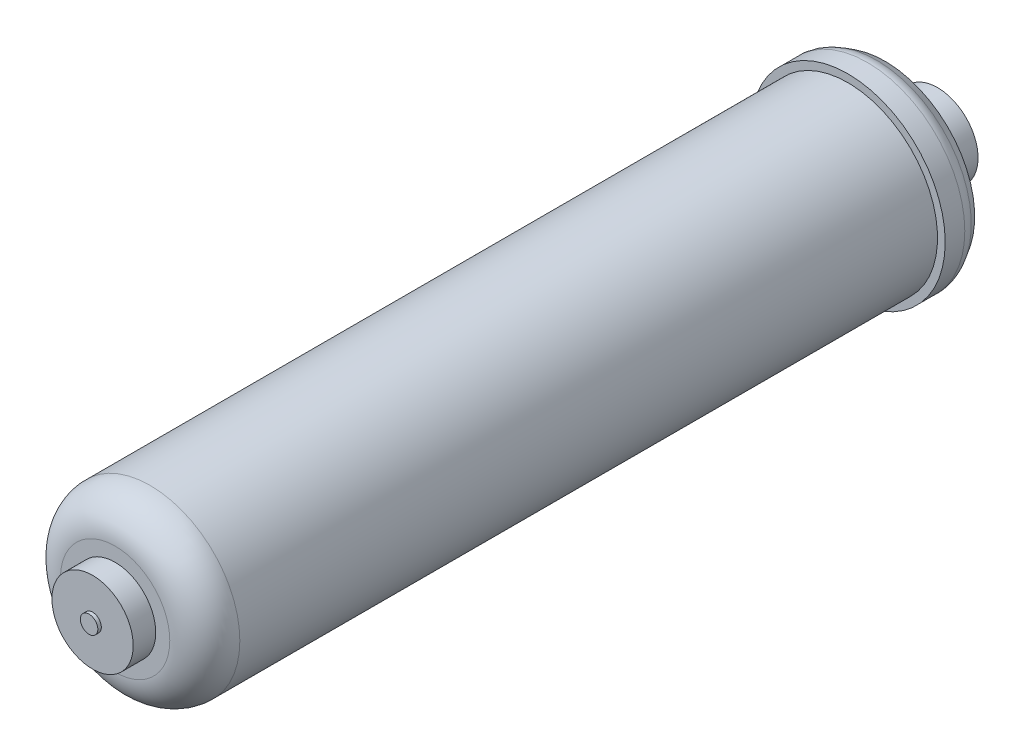
ISO-10303-21;
HEADER;
FILE_DESCRIPTION(('STEP AP214'),'2;1');
FILE_NAME('part.step','',(''),(''),'','','');
FILE_SCHEMA(('AUTOMOTIVE_DESIGN { 1 0 10303 214 1 1 1 1 }'));
ENDSEC;
DATA;
#1=APPLICATION_CONTEXT('core data for automotive mechanical design processes');
#2=APPLICATION_PROTOCOL_DEFINITION('international standard','automotive_design',2000,#1);
#3=PRODUCT_CONTEXT('',#1,'mechanical');
#4=PRODUCT('Part','Part','',(#3));
#5=PRODUCT_RELATED_PRODUCT_CATEGORY('part','',(#4));
#6=PRODUCT_DEFINITION_FORMATION('','',#4);
#7=PRODUCT_DEFINITION_CONTEXT('part definition',#1,'design');
#8=PRODUCT_DEFINITION('design','',#6,#7);
#9=PRODUCT_DEFINITION_SHAPE('','',#8);
#10=(LENGTH_UNIT() NAMED_UNIT(*) SI_UNIT(.MILLI.,.METRE.));
#11=(NAMED_UNIT(*) PLANE_ANGLE_UNIT() SI_UNIT($,.RADIAN.));
#12=(NAMED_UNIT(*) SI_UNIT($,.STERADIAN.) SOLID_ANGLE_UNIT());
#13=UNCERTAINTY_MEASURE_WITH_UNIT(LENGTH_MEASURE(1.E-05),#10,'distance_accuracy_value','');
#14=(GEOMETRIC_REPRESENTATION_CONTEXT(3) GLOBAL_UNCERTAINTY_ASSIGNED_CONTEXT((#13)) GLOBAL_UNIT_ASSIGNED_CONTEXT((#10,
#11,#12)) REPRESENTATION_CONTEXT('',''));
#15=CARTESIAN_POINT('',(0.,0.,0.));
#16=DIRECTION('',(0.,0.,1.));
#17=DIRECTION('',(1.,0.,0.));
#18=AXIS2_PLACEMENT_3D('',#15,#16,#17);
#19=CARTESIAN_POINT('',(0.,0.,0.));
#20=DIRECTION('',(0.,0.,-1.));
#21=DIRECTION('',(-1.,0.,0.));
#22=AXIS2_PLACEMENT_3D('',#19,#20,#21);
#23=PLANE('',#22);
#24=CARTESIAN_POINT('',(0.,0.,0.));
#25=DIRECTION('',(0.,0.,-1.));
#26=DIRECTION('',(-1.,0.,0.));
#27=AXIS2_PLACEMENT_3D('',#24,#25,#26);
#28=CIRCLE('',#27,3.175);
#29=CARTESIAN_POINT('',(-3.175,0.,0.));
#30=VERTEX_POINT('',#29);
#31=EDGE_CURVE('E50',#30,#30,#28,.T.);
#32=ORIENTED_EDGE('',*,*,#31,.T.);
#33=EDGE_LOOP('',(#32));
#34=FACE_BOUND('',#33,.T.);
#35=ADVANCED_FACE('F30',(#34),#23,.T.);
#36=CARTESIAN_POINT('',(0.,0.,0.));
#37=DIRECTION('',(0.,0.,-1.));
#38=DIRECTION('',(-1.,0.,0.));
#39=AXIS2_PLACEMENT_3D('',#36,#37,#38);
#40=CYLINDRICAL_SURFACE('',#39,3.175);
#41=CARTESIAN_POINT('',(0.,0.,1.27));
#42=DIRECTION('',(0.,0.,-1.));
#43=DIRECTION('',(-1.,0.,0.));
#44=AXIS2_PLACEMENT_3D('',#41,#42,#43);
#45=CIRCLE('',#44,3.175);
#46=CARTESIAN_POINT('',(-3.175,0.,1.27));
#47=VERTEX_POINT('',#46);
#48=EDGE_CURVE('E53',#47,#47,#45,.T.);
#49=ORIENTED_EDGE('',*,*,#48,.T.);
#50=EDGE_LOOP('',(#49));
#51=FACE_BOUND('',#50,.T.);
#52=ORIENTED_EDGE('',*,*,#31,.F.);
#53=EDGE_LOOP('',(#52));
#54=FACE_BOUND('',#53,.T.);
#55=ADVANCED_FACE('F99',(#51,#54),#40,.T.);
#56=CARTESIAN_POINT('',(0.,3.175,1.27));
#57=DIRECTION('',(0.,0.,-1.));
#58=DIRECTION('',(-1.,0.,0.));
#59=AXIS2_PLACEMENT_3D('',#56,#57,#58);
#60=PLANE('',#59);
#61=CARTESIAN_POINT('',(0.,0.,1.27));
#62=DIRECTION('',(0.,0.,-1.));
#63=DIRECTION('',(-1.,0.,0.));
#64=AXIS2_PLACEMENT_3D('',#61,#62,#63);
#65=CIRCLE('',#64,14.732);
#66=CARTESIAN_POINT('',(-14.732,0.,1.27));
#67=VERTEX_POINT('',#66);
#68=EDGE_CURVE('E56',#67,#67,#65,.T.);
#69=ORIENTED_EDGE('',*,*,#68,.T.);
#70=EDGE_LOOP('',(#69));
#71=FACE_BOUND('',#70,.T.);
#72=ORIENTED_EDGE('',*,*,#48,.F.);
#73=EDGE_LOOP('',(#72));
#74=FACE_BOUND('',#73,.T.);
#75=ADVANCED_FACE('F105',(#71,#74),#60,.T.);
#76=CARTESIAN_POINT('',(0.,0.,0.));
#77=DIRECTION('',(0.,0.,-1.));
#78=DIRECTION('',(-1.,0.,0.));
#79=AXIS2_PLACEMENT_3D('',#76,#77,#78);
#80=CYLINDRICAL_SURFACE('',#79,14.732);
#81=CARTESIAN_POINT('',(0.,0.,9.398));
#82=DIRECTION('',(0.,0.,-1.));
#83=DIRECTION('',(-1.,0.,0.));
#84=AXIS2_PLACEMENT_3D('',#81,#82,#83);
#85=CIRCLE('',#84,14.732);
#86=CARTESIAN_POINT('',(-14.732,0.,9.398));
#87=VERTEX_POINT('',#86);
#88=EDGE_CURVE('E59',#87,#87,#85,.T.);
#89=ORIENTED_EDGE('',*,*,#88,.T.);
#90=EDGE_LOOP('',(#89));
#91=FACE_BOUND('',#90,.T.);
#92=ORIENTED_EDGE('',*,*,#68,.F.);
#93=EDGE_LOOP('',(#92));
#94=FACE_BOUND('',#93,.T.);
#95=ADVANCED_FACE('F111',(#91,#94),#80,.T.);
#96=CARTESIAN_POINT('',(0.,0.,9.398));
#97=DIRECTION('',(0.,0.,1.));
#98=DIRECTION('',(1.,0.,0.));
#99=AXIS2_PLACEMENT_3D('',#96,#97,#98);
#100=CONICAL_SURFACE('',#99,14.732,1.02101761241669);
#101=CARTESIAN_POINT('',(0.,0.,20.32));
#102=DIRECTION('',(0.,0.,-1.));
#103=DIRECTION('',(-1.,0.,0.));
#104=AXIS2_PLACEMENT_3D('',#101,#102,#103);
#105=CIRCLE('',#104,32.5550841268207);
#106=CARTESIAN_POINT('',(-32.5550841268207,0.,20.32));
#107=VERTEX_POINT('',#106);
#108=EDGE_CURVE('E62',#107,#107,#105,.T.);
#109=ORIENTED_EDGE('',*,*,#108,.T.);
#110=EDGE_LOOP('',(#109));
#111=FACE_BOUND('',#110,.T.);
#112=ORIENTED_EDGE('',*,*,#88,.F.);
#113=EDGE_LOOP('',(#112));
#114=FACE_BOUND('',#113,.T.);
#115=ADVANCED_FACE('F115',(#111,#114),#100,.T.);
#116=CARTESIAN_POINT('',(0.,0.,20.32));
#117=DIRECTION('',(0.,0.,1.));
#118=DIRECTION('',(1.,0.,0.));
#119=AXIS2_PLACEMENT_3D('',#116,#117,#118);
#120=CONICAL_SURFACE('',#119,32.5550841268207,0.541659485455927);
#121=CARTESIAN_POINT('',(0.,0.,23.3812905502817));
#122=DIRECTION('',(0.,0.,-1.));
#123=DIRECTION('',(-1.,0.,0.));
#124=AXIS2_PLACEMENT_3D('',#121,#122,#123);
#125=CIRCLE('',#124,34.3970248020577);
#126=CARTESIAN_POINT('',(-34.3970248020577,0.,23.3812905502817));
#127=VERTEX_POINT('',#126);
#128=EDGE_CURVE('E37',#127,#127,#125,.T.);
#129=ORIENTED_EDGE('',*,*,#128,.T.);
#130=EDGE_LOOP('',(#129));
#131=FACE_BOUND('',#130,.T.);
#132=ORIENTED_EDGE('',*,*,#108,.F.);
#133=EDGE_LOOP('',(#132));
#134=FACE_BOUND('',#133,.T.);
#135=ADVANCED_FACE('F119',(#131,#134),#120,.T.);
#136=CARTESIAN_POINT('',(0.,0.,0.));
#137=DIRECTION('',(0.,0.,-1.));
#138=DIRECTION('',(-1.,0.,0.));
#139=AXIS2_PLACEMENT_3D('',#136,#137,#138);
#140=CYLINDRICAL_SURFACE('',#139,35.306);
#141=CARTESIAN_POINT('',(0.,0.,26.6550879025001));
#142=DIRECTION('',(0.,0.,1.));
#143=DIRECTION('',(1.,0.,0.));
#144=AXIS2_PLACEMENT_3D('',#141,#142,#143);
#145=CIRCLE('',#144,35.306);
#146=CARTESIAN_POINT('',(35.306,0.,26.6550879025001));
#147=VERTEX_POINT('',#146);
#148=EDGE_CURVE('E10',#147,#147,#145,.T.);
#149=ORIENTED_EDGE('',*,*,#148,.T.);
#150=EDGE_LOOP('',(#149));
#151=FACE_BOUND('',#150,.T.);
#152=CARTESIAN_POINT('',(0.,0.,33.7566));
#153=DIRECTION('',(0.,0.,-1.));
#154=DIRECTION('',(-1.,0.,0.));
#155=AXIS2_PLACEMENT_3D('',#152,#153,#154);
#156=CIRCLE('',#155,35.306);
#157=CARTESIAN_POINT('',(-35.306,0.,33.7566));
#158=VERTEX_POINT('',#157);
#159=EDGE_CURVE('E65',#158,#158,#156,.T.);
#160=ORIENTED_EDGE('',*,*,#159,.T.);
#161=EDGE_LOOP('',(#160));
#162=FACE_BOUND('',#161,.T.);
#163=ADVANCED_FACE('F123',(#151,#162),#140,.T.);
#164=CARTESIAN_POINT('',(0.,35.306,33.7566));
#165=DIRECTION('',(0.,0.,1.));
#166=DIRECTION('',(1.,0.,0.));
#167=AXIS2_PLACEMENT_3D('',#164,#165,#166);
#168=PLANE('',#167);
#169=CARTESIAN_POINT('',(0.,0.,33.7566));
#170=DIRECTION('',(0.,0.,-1.));
#171=DIRECTION('',(-1.,0.,0.));
#172=AXIS2_PLACEMENT_3D('',#169,#170,#171);
#173=CIRCLE('',#172,32.512);
#174=CARTESIAN_POINT('',(-32.512,0.,33.7566));
#175=VERTEX_POINT('',#174);
#176=EDGE_CURVE('E68',#175,#175,#173,.T.);
#177=ORIENTED_EDGE('',*,*,#176,.T.);
#178=EDGE_LOOP('',(#177));
#179=FACE_BOUND('',#178,.T.);
#180=ORIENTED_EDGE('',*,*,#159,.F.);
#181=EDGE_LOOP('',(#180));
#182=FACE_BOUND('',#181,.T.);
#183=ADVANCED_FACE('F126',(#179,#182),#168,.T.);
#184=CARTESIAN_POINT('',(0.,0.,0.));
#185=DIRECTION('',(0.,0.,-1.));
#186=DIRECTION('',(-1.,0.,0.));
#187=AXIS2_PLACEMENT_3D('',#184,#185,#186);
#188=CYLINDRICAL_SURFACE('',#187,32.512);
#189=CARTESIAN_POINT('',(0.,0.,286.7152));
#190=DIRECTION('',(0.,0.,1.));
#191=DIRECTION('',(1.,0.,0.));
#192=AXIS2_PLACEMENT_3D('',#189,#190,#191);
#193=CIRCLE('',#192,32.512);
#194=CARTESIAN_POINT('',(32.512,0.,286.7152));
#195=VERTEX_POINT('',#194);
#196=EDGE_CURVE('E45',#195,#195,#193,.F.);
#197=ORIENTED_EDGE('',*,*,#196,.T.);
#198=EDGE_LOOP('',(#197));
#199=FACE_BOUND('',#198,.T.);
#200=ORIENTED_EDGE('',*,*,#176,.F.);
#201=EDGE_LOOP('',(#200));
#202=FACE_BOUND('',#201,.T.);
#203=ADVANCED_FACE('F129',(#199,#202),#188,.T.);
#204=CARTESIAN_POINT('',(0.,32.512,299.4152));
#205=DIRECTION('',(0.,0.,1.));
#206=DIRECTION('',(1.,0.,0.));
#207=AXIS2_PLACEMENT_3D('',#204,#205,#206);
#208=PLANE('',#207);
#209=CARTESIAN_POINT('',(0.,0.,299.4152));
#210=DIRECTION('',(0.,0.,1.));
#211=DIRECTION('',(1.,0.,0.));
#212=AXIS2_PLACEMENT_3D('',#209,#210,#211);
#213=CIRCLE('',#212,19.812);
#214=CARTESIAN_POINT('',(19.812,0.,299.4152));
#215=VERTEX_POINT('',#214);
#216=EDGE_CURVE('E41',#215,#215,#213,.T.);
#217=ORIENTED_EDGE('',*,*,#216,.T.);
#218=EDGE_LOOP('',(#217));
#219=FACE_BOUND('',#218,.T.);
#220=CARTESIAN_POINT('',(0.,0.,299.4152));
#221=DIRECTION('',(0.,0.,-1.));
#222=DIRECTION('',(-1.,0.,0.));
#223=AXIS2_PLACEMENT_3D('',#220,#221,#222);
#224=CIRCLE('',#223,14.732);
#225=CARTESIAN_POINT('',(-14.732,0.,299.4152));
#226=VERTEX_POINT('',#225);
#227=EDGE_CURVE('E71',#226,#226,#224,.T.);
#228=ORIENTED_EDGE('',*,*,#227,.T.);
#229=EDGE_LOOP('',(#228));
#230=FACE_BOUND('',#229,.T.);
#231=ADVANCED_FACE('F133',(#219,#230),#208,.T.);
#232=CARTESIAN_POINT('',(0.,0.,0.));
#233=DIRECTION('',(0.,0.,-1.));
#234=DIRECTION('',(-1.,0.,0.));
#235=AXIS2_PLACEMENT_3D('',#232,#233,#234);
#236=CYLINDRICAL_SURFACE('',#235,14.732);
#237=CARTESIAN_POINT('',(0.,0.,307.594));
#238=DIRECTION('',(0.,0.,-1.));
#239=DIRECTION('',(-1.,0.,0.));
#240=AXIS2_PLACEMENT_3D('',#237,#238,#239);
#241=CIRCLE('',#240,14.732);
#242=CARTESIAN_POINT('',(-14.732,0.,307.594));
#243=VERTEX_POINT('',#242);
#244=EDGE_CURVE('E74',#243,#243,#241,.T.);
#245=ORIENTED_EDGE('',*,*,#244,.T.);
#246=EDGE_LOOP('',(#245));
#247=FACE_BOUND('',#246,.T.);
#248=ORIENTED_EDGE('',*,*,#227,.F.);
#249=EDGE_LOOP('',(#248));
#250=FACE_BOUND('',#249,.T.);
#251=ADVANCED_FACE('F137',(#247,#250),#236,.T.);
#252=CARTESIAN_POINT('',(0.,14.732,307.594));
#253=DIRECTION('',(0.,0.,1.));
#254=DIRECTION('',(1.,0.,0.));
#255=AXIS2_PLACEMENT_3D('',#252,#253,#254);
#256=PLANE('',#255);
#257=CARTESIAN_POINT('',(0.,0.,307.594));
#258=DIRECTION('',(0.,0.,-1.));
#259=DIRECTION('',(-1.,0.,0.));
#260=AXIS2_PLACEMENT_3D('',#257,#258,#259);
#261=CIRCLE('',#260,3.17499999999996);
#262=CARTESIAN_POINT('',(-3.17499999999996,0.,307.594));
#263=VERTEX_POINT('',#262);
#264=EDGE_CURVE('E77',#263,#263,#261,.T.);
#265=ORIENTED_EDGE('',*,*,#264,.T.);
#266=EDGE_LOOP('',(#265));
#267=FACE_BOUND('',#266,.T.);
#268=ORIENTED_EDGE('',*,*,#244,.F.);
#269=EDGE_LOOP('',(#268));
#270=FACE_BOUND('',#269,.T.);
#271=ADVANCED_FACE('F96',(#267,#270),#256,.T.);
#272=CARTESIAN_POINT('',(0.,0.,0.));
#273=DIRECTION('',(0.,0.,-1.));
#274=DIRECTION('',(-1.,0.,0.));
#275=AXIS2_PLACEMENT_3D('',#272,#273,#274);
#276=CYLINDRICAL_SURFACE('',#275,3.17499999999996);
#277=CARTESIAN_POINT('',(0.,0.,308.864));
#278=DIRECTION('',(0.,0.,-1.));
#279=DIRECTION('',(-1.,0.,0.));
#280=AXIS2_PLACEMENT_3D('',#277,#278,#279);
#281=CIRCLE('',#280,3.17499999999996);
#282=CARTESIAN_POINT('',(-3.17499999999996,0.,308.864));
#283=VERTEX_POINT('',#282);
#284=EDGE_CURVE('E80',#283,#283,#281,.T.);
#285=ORIENTED_EDGE('',*,*,#284,.T.);
#286=EDGE_LOOP('',(#285));
#287=FACE_BOUND('',#286,.T.);
#288=ORIENTED_EDGE('',*,*,#264,.F.);
#289=EDGE_LOOP('',(#288));
#290=FACE_BOUND('',#289,.T.);
#291=ADVANCED_FACE('F84',(#287,#290),#276,.T.);
#292=CARTESIAN_POINT('',(0.,3.17499999999996,308.864));
#293=DIRECTION('',(0.,0.,1.));
#294=DIRECTION('',(1.,0.,0.));
#295=AXIS2_PLACEMENT_3D('',#292,#293,#294);
#296=PLANE('',#295);
#297=ORIENTED_EDGE('',*,*,#284,.F.);
#298=EDGE_LOOP('',(#297));
#299=FACE_BOUND('',#298,.T.);
#300=ADVANCED_FACE('F87',(#299),#296,.T.);
#301=CARTESIAN_POINT('',(0.,0.,286.7152));
#302=DIRECTION('',(0.,0.,1.));
#303=DIRECTION('',(1.,0.,0.));
#304=AXIS2_PLACEMENT_3D('',#301,#302,#303);
#305=TOROIDAL_SURFACE('',#304,19.812,12.7);
#306=ORIENTED_EDGE('',*,*,#216,.F.);
#307=EDGE_LOOP('',(#306));
#308=FACE_BOUND('',#307,.T.);
#309=ORIENTED_EDGE('',*,*,#196,.F.);
#310=EDGE_LOOP('',(#309));
#311=FACE_BOUND('',#310,.T.);
#312=ADVANCED_FACE('F89',(#308,#311),#305,.T.);
#313=CARTESIAN_POINT('',(0.,0.,26.6550879025001));
#314=DIRECTION('',(0.,0.,1.));
#315=DIRECTION('',(1.,0.,0.));
#316=AXIS2_PLACEMENT_3D('',#313,#314,#315);
#317=TOROIDAL_SURFACE('',#316,28.956,6.35);
#318=ORIENTED_EDGE('',*,*,#148,.F.);
#319=EDGE_LOOP('',(#318));
#320=FACE_BOUND('',#319,.T.);
#321=ORIENTED_EDGE('',*,*,#128,.F.);
#322=EDGE_LOOP('',(#321));
#323=FACE_BOUND('',#322,.T.);
#324=ADVANCED_FACE('F32',(#320,#323),#317,.T.);
#325=CLOSED_SHELL('',(#35,#55,#75,#95,#115,#135,#163,#183,#203,#231,#251,#271,#291,#300,#312,#324));
#326=MANIFOLD_SOLID_BREP('B2',#325);
#327=ADVANCED_BREP_SHAPE_REPRESENTATION('',(#18,#326),#14);
#328=SHAPE_DEFINITION_REPRESENTATION(#9,#327);
ENDSEC;
END-ISO-10303-21;
